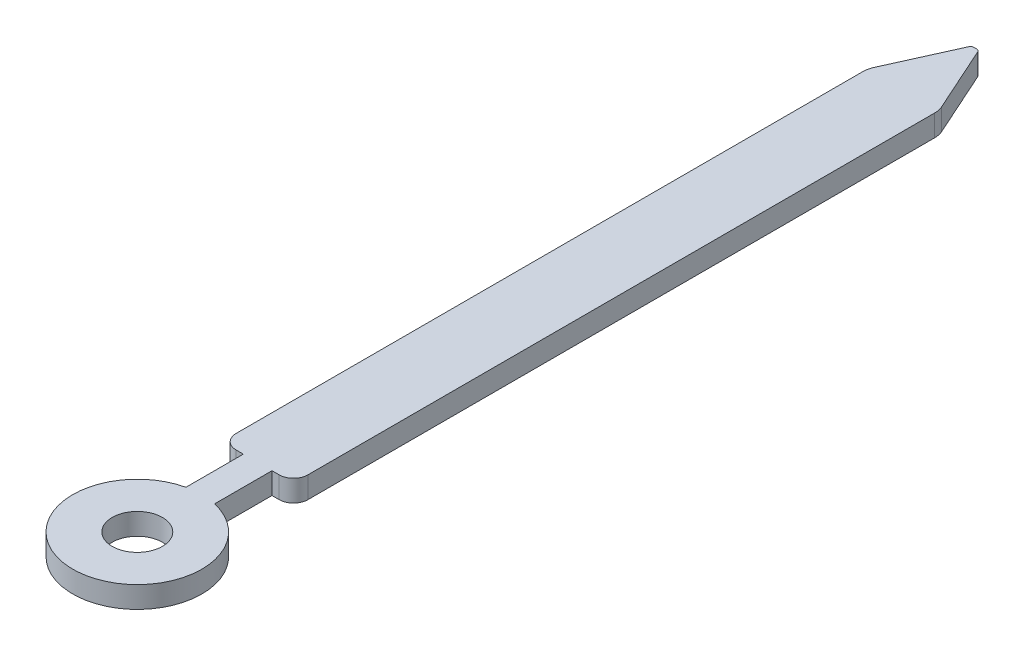
ISO-10303-21;
HEADER;
FILE_DESCRIPTION(('STEP AP214'),'2;1');
FILE_NAME('part.step','',(''),(''),'','','');
FILE_SCHEMA(('AUTOMOTIVE_DESIGN { 1 0 10303 214 1 1 1 1 }'));
ENDSEC;
DATA;
#1=APPLICATION_CONTEXT('core data for automotive mechanical design processes');
#2=APPLICATION_PROTOCOL_DEFINITION('international standard','automotive_design',2000,#1);
#3=PRODUCT_CONTEXT('',#1,'mechanical');
#4=PRODUCT('Part','Part','',(#3));
#5=PRODUCT_RELATED_PRODUCT_CATEGORY('part','',(#4));
#6=PRODUCT_DEFINITION_FORMATION('','',#4);
#7=PRODUCT_DEFINITION_CONTEXT('part definition',#1,'design');
#8=PRODUCT_DEFINITION('design','',#6,#7);
#9=PRODUCT_DEFINITION_SHAPE('','',#8);
#10=(LENGTH_UNIT() NAMED_UNIT(*) SI_UNIT(.MILLI.,.METRE.));
#11=(NAMED_UNIT(*) PLANE_ANGLE_UNIT() SI_UNIT($,.RADIAN.));
#12=(NAMED_UNIT(*) SI_UNIT($,.STERADIAN.) SOLID_ANGLE_UNIT());
#13=UNCERTAINTY_MEASURE_WITH_UNIT(LENGTH_MEASURE(1.E-05),#10,'distance_accuracy_value','');
#14=(GEOMETRIC_REPRESENTATION_CONTEXT(3) GLOBAL_UNCERTAINTY_ASSIGNED_CONTEXT((#13)) GLOBAL_UNIT_ASSIGNED_CONTEXT((#10,
#11,#12)) REPRESENTATION_CONTEXT('',''));
#15=CARTESIAN_POINT('',(0.,0.,0.));
#16=DIRECTION('',(0.,0.,1.));
#17=DIRECTION('',(1.,0.,0.));
#18=AXIS2_PLACEMENT_3D('',#15,#16,#17);
#19=CARTESIAN_POINT('',(-0.0183173051113198,0.3,-9.951));
#20=DIRECTION('',(0.,-1.,0.));
#21=DIRECTION('',(0.,0.,-1.));
#22=AXIS2_PLACEMENT_3D('',#19,#20,#21);
#23=PLANE('',#22);
#24=CARTESIAN_POINT('',(-0.0183173051113198,0.3,-9.951));
#25=DIRECTION('',(0.,1.,0.));
#26=DIRECTION('',(0.,0.,-1.));
#27=AXIS2_PLACEMENT_3D('',#24,#25,#26);
#28=CIRCLE('',#27,0.0490000000000003);
#29=CARTESIAN_POINT('',(-0.0183173051113196,0.3,-10.));
#30=VERTEX_POINT('',#29);
#31=CARTESIAN_POINT('',(-0.0630014588649001,0.3,-9.97110786918911));
#32=VERTEX_POINT('',#31);
#33=EDGE_CURVE('E207',#30,#32,#28,.T.);
#34=ORIENTED_EDGE('',*,*,#33,.T.);
#35=DIRECTION('',(-0.410364677328798,0.,0.911921505175106));
#36=VECTOR('',#35,1.);
#37=CARTESIAN_POINT('',(-0.0630014588649001,0.3,-9.97110786918911));
#38=LINE('',#37,#36);
#39=CARTESIAN_POINT('',(-0.473576451552531,0.3,-9.05871899654993));
#40=VERTEX_POINT('',#39);
#41=EDGE_CURVE('E115',#32,#40,#38,.T.);
#42=ORIENTED_EDGE('',*,*,#41,.T.);
#43=CARTESIAN_POINT('',(-0.2,0.3,-8.93560959335129));
#44=DIRECTION('',(0.,1.,0.));
#45=DIRECTION('',(0.,0.,1.));
#46=AXIS2_PLACEMENT_3D('',#43,#44,#45);
#47=CIRCLE('',#46,0.3);
#48=CARTESIAN_POINT('',(-0.5,0.3,-8.93560959335129));
#49=VERTEX_POINT('',#48);
#50=EDGE_CURVE('E246',#40,#49,#47,.T.);
#51=ORIENTED_EDGE('',*,*,#50,.T.);
#52=DIRECTION('',(0.,0.,1.));
#53=VECTOR('',#52,1.);
#54=CARTESIAN_POINT('',(-0.5,0.3,-0.200000000000001));
#55=LINE('',#54,#53);
#56=CARTESIAN_POINT('',(-0.5,0.3,-0.200000000000001));
#57=VERTEX_POINT('',#56);
#58=EDGE_CURVE('E265',#49,#57,#55,.T.);
#59=ORIENTED_EDGE('',*,*,#58,.T.);
#60=CARTESIAN_POINT('',(-0.3,0.3,-0.2));
#61=DIRECTION('',(0.,1.,0.));
#62=DIRECTION('',(0.,0.,-1.));
#63=AXIS2_PLACEMENT_3D('',#60,#61,#62);
#64=CIRCLE('',#63,0.2);
#65=CARTESIAN_POINT('',(-0.299999999999999,0.3,0.));
#66=VERTEX_POINT('',#65);
#67=EDGE_CURVE('E262',#57,#66,#64,.T.);
#68=ORIENTED_EDGE('',*,*,#67,.T.);
#69=DIRECTION('',(1.,0.,0.));
#70=VECTOR('',#69,1.);
#71=CARTESIAN_POINT('',(-0.299999999999999,0.3,0.));
#72=LINE('',#71,#70);
#73=CARTESIAN_POINT('',(-0.2,0.3,0.));
#74=VERTEX_POINT('',#73);
#75=EDGE_CURVE('E264',#66,#74,#72,.T.);
#76=ORIENTED_EDGE('',*,*,#75,.T.);
#77=DIRECTION('',(0.,0.,1.));
#78=VECTOR('',#77,1.);
#79=CARTESIAN_POINT('',(-0.2,0.3,0.));
#80=LINE('',#79,#78);
#81=CARTESIAN_POINT('',(-0.199999999999999,0.3,0.8));
#82=VERTEX_POINT('',#81);
#83=EDGE_CURVE('E267',#74,#82,#80,.T.);
#84=ORIENTED_EDGE('',*,*,#83,.T.);
#85=CARTESIAN_POINT('',(0.,0.3,1.67749643873921));
#86=DIRECTION('',(0.,1.,0.));
#87=DIRECTION('',(0.,0.,1.));
#88=AXIS2_PLACEMENT_3D('',#85,#86,#87);
#89=CIRCLE('',#88,0.9);
#90=CARTESIAN_POINT('',(0.200000000000001,0.3,0.8));
#91=VERTEX_POINT('',#90);
#92=EDGE_CURVE('E273',#82,#91,#89,.T.);
#93=ORIENTED_EDGE('',*,*,#92,.T.);
#94=DIRECTION('',(0.,0.,-1.));
#95=VECTOR('',#94,1.);
#96=CARTESIAN_POINT('',(0.2,0.3,0.));
#97=LINE('',#96,#95);
#98=CARTESIAN_POINT('',(0.2,0.3,0.));
#99=VERTEX_POINT('',#98);
#100=EDGE_CURVE('E275',#91,#99,#97,.T.);
#101=ORIENTED_EDGE('',*,*,#100,.T.);
#102=DIRECTION('',(1.,0.,0.));
#103=VECTOR('',#102,1.);
#104=CARTESIAN_POINT('',(0.2,0.3,0.));
#105=LINE('',#104,#103);
#106=CARTESIAN_POINT('',(0.299999999999999,0.3,0.));
#107=VERTEX_POINT('',#106);
#108=EDGE_CURVE('E277',#99,#107,#105,.T.);
#109=ORIENTED_EDGE('',*,*,#108,.T.);
#110=CARTESIAN_POINT('',(0.3,0.3,-0.2));
#111=DIRECTION('',(0.,1.,0.));
#112=DIRECTION('',(0.,0.,1.));
#113=AXIS2_PLACEMENT_3D('',#110,#111,#112);
#114=CIRCLE('',#113,0.2);
#115=CARTESIAN_POINT('',(0.5,0.3,-0.200000000000001));
#116=VERTEX_POINT('',#115);
#117=EDGE_CURVE('E279',#107,#116,#114,.T.);
#118=ORIENTED_EDGE('',*,*,#117,.T.);
#119=DIRECTION('',(0.,0.,-1.));
#120=VECTOR('',#119,1.);
#121=CARTESIAN_POINT('',(0.5,0.3,-0.200000000000001));
#122=LINE('',#121,#120);
#123=CARTESIAN_POINT('',(0.5,0.3,-8.93560959335129));
#124=VERTEX_POINT('',#123);
#125=EDGE_CURVE('E281',#116,#124,#122,.T.);
#126=ORIENTED_EDGE('',*,*,#125,.T.);
#127=CARTESIAN_POINT('',(0.2,0.3,-8.93560959335129));
#128=DIRECTION('',(0.,1.,0.));
#129=DIRECTION('',(0.,0.,-1.));
#130=AXIS2_PLACEMENT_3D('',#127,#128,#129);
#131=CIRCLE('',#130,0.3);
#132=CARTESIAN_POINT('',(0.473576451552531,0.3,-9.05871899654993));
#133=VERTEX_POINT('',#132);
#134=EDGE_CURVE('E158',#124,#133,#131,.T.);
#135=ORIENTED_EDGE('',*,*,#134,.T.);
#136=DIRECTION('',(-0.410364677328798,0.,-0.911921505175106));
#137=VECTOR('',#136,1.);
#138=CARTESIAN_POINT('',(0.0630014588649001,0.3,-9.97110786918911));
#139=LINE('',#138,#137);
#140=CARTESIAN_POINT('',(0.0630014588649001,0.3,-9.97110786918911));
#141=VERTEX_POINT('',#140);
#142=EDGE_CURVE('E152',#133,#141,#139,.T.);
#143=ORIENTED_EDGE('',*,*,#142,.T.);
#144=CARTESIAN_POINT('',(0.0183173051113198,0.3,-9.951));
#145=DIRECTION('',(0.,1.,0.));
#146=DIRECTION('',(0.,0.,1.));
#147=AXIS2_PLACEMENT_3D('',#144,#145,#146);
#148=CIRCLE('',#147,0.0490000000000003);
#149=CARTESIAN_POINT('',(0.0183173051113196,0.3,-10.));
#150=VERTEX_POINT('',#149);
#151=EDGE_CURVE('E156',#141,#150,#148,.T.);
#152=ORIENTED_EDGE('',*,*,#151,.T.);
#153=DIRECTION('',(-1.,0.,0.));
#154=VECTOR('',#153,1.);
#155=CARTESIAN_POINT('',(-0.0183173051113196,0.3,-10.));
#156=LINE('',#155,#154);
#157=EDGE_CURVE('E48',#150,#30,#156,.T.);
#158=ORIENTED_EDGE('',*,*,#157,.T.);
#159=EDGE_LOOP('',(#34,#42,#51,#59,#68,#76,#84,#93,#101,#109,#118,#126,#135,#143,#152,#158));
#160=FACE_BOUND('',#159,.T.);
#161=CARTESIAN_POINT('',(0.,0.3,1.67749643873921));
#162=DIRECTION('',(0.,1.,0.));
#163=DIRECTION('',(0.,0.,1.));
#164=AXIS2_PLACEMENT_3D('',#161,#162,#163);
#165=CIRCLE('',#164,0.35);
#166=CARTESIAN_POINT('',(0.,0.3,2.02749643873921));
#167=VERTEX_POINT('',#166);
#168=EDGE_CURVE('E180',#167,#167,#165,.T.);
#169=ORIENTED_EDGE('',*,*,#168,.F.);
#170=EDGE_LOOP('',(#169));
#171=FACE_BOUND('',#170,.T.);
#172=ADVANCED_FACE('F31',(#160,#171),#23,.F.);
#173=CARTESIAN_POINT('',(-0.0183173051113198,0.,-9.951));
#174=DIRECTION('',(0.,-1.,0.));
#175=DIRECTION('',(0.,0.,-1.));
#176=AXIS2_PLACEMENT_3D('',#173,#174,#175);
#177=PLANE('',#176);
#178=CARTESIAN_POINT('',(-0.0183173051113198,0.,-9.951));
#179=DIRECTION('',(0.,1.,0.));
#180=DIRECTION('',(0.,0.,-1.));
#181=AXIS2_PLACEMENT_3D('',#178,#179,#180);
#182=CIRCLE('',#181,0.0490000000000003);
#183=CARTESIAN_POINT('',(-0.0183173051113196,0.,-10.));
#184=VERTEX_POINT('',#183);
#185=CARTESIAN_POINT('',(-0.0630014588649001,0.,-9.97110786918911));
#186=VERTEX_POINT('',#185);
#187=EDGE_CURVE('E176',#184,#186,#182,.T.);
#188=ORIENTED_EDGE('',*,*,#187,.F.);
#189=DIRECTION('',(-1.,0.,0.));
#190=VECTOR('',#189,1.);
#191=CARTESIAN_POINT('',(-0.0183173051113196,0.,-10.));
#192=LINE('',#191,#190);
#193=CARTESIAN_POINT('',(0.0183173051113196,0.,-10.));
#194=VERTEX_POINT('',#193);
#195=EDGE_CURVE('E107',#194,#184,#192,.T.);
#196=ORIENTED_EDGE('',*,*,#195,.F.);
#197=CARTESIAN_POINT('',(0.0183173051113198,0.,-9.951));
#198=DIRECTION('',(0.,1.,0.));
#199=DIRECTION('',(0.,0.,1.));
#200=AXIS2_PLACEMENT_3D('',#197,#198,#199);
#201=CIRCLE('',#200,0.0490000000000003);
#202=CARTESIAN_POINT('',(0.0630014588649001,0.,-9.97110786918911));
#203=VERTEX_POINT('',#202);
#204=EDGE_CURVE('E101',#203,#194,#201,.T.);
#205=ORIENTED_EDGE('',*,*,#204,.F.);
#206=DIRECTION('',(-0.410364677328798,0.,-0.911921505175106));
#207=VECTOR('',#206,1.);
#208=CARTESIAN_POINT('',(0.0630014588649001,0.,-9.97110786918911));
#209=LINE('',#208,#207);
#210=CARTESIAN_POINT('',(0.473576451552531,0.,-9.05871899654993));
#211=VERTEX_POINT('',#210);
#212=EDGE_CURVE('E166',#211,#203,#209,.T.);
#213=ORIENTED_EDGE('',*,*,#212,.F.);
#214=CARTESIAN_POINT('',(0.2,0.,-8.93560959335129));
#215=DIRECTION('',(0.,1.,0.));
#216=DIRECTION('',(0.,0.,-1.));
#217=AXIS2_PLACEMENT_3D('',#214,#215,#216);
#218=CIRCLE('',#217,0.3);
#219=CARTESIAN_POINT('',(0.5,0.,-8.93560959335129));
#220=VERTEX_POINT('',#219);
#221=EDGE_CURVE('E202',#220,#211,#218,.T.);
#222=ORIENTED_EDGE('',*,*,#221,.F.);
#223=DIRECTION('',(0.,0.,-1.));
#224=VECTOR('',#223,1.);
#225=CARTESIAN_POINT('',(0.5,0.,-0.200000000000001));
#226=LINE('',#225,#224);
#227=CARTESIAN_POINT('',(0.5,0.,-0.200000000000001));
#228=VERTEX_POINT('',#227);
#229=EDGE_CURVE('E200',#228,#220,#226,.T.);
#230=ORIENTED_EDGE('',*,*,#229,.F.);
#231=CARTESIAN_POINT('',(0.3,0.,-0.2));
#232=DIRECTION('',(0.,1.,0.));
#233=DIRECTION('',(0.,0.,1.));
#234=AXIS2_PLACEMENT_3D('',#231,#232,#233);
#235=CIRCLE('',#234,0.2);
#236=CARTESIAN_POINT('',(0.299999999999999,0.,0.));
#237=VERTEX_POINT('',#236);
#238=EDGE_CURVE('E198',#237,#228,#235,.T.);
#239=ORIENTED_EDGE('',*,*,#238,.F.);
#240=DIRECTION('',(1.,0.,0.));
#241=VECTOR('',#240,1.);
#242=CARTESIAN_POINT('',(0.2,0.,0.));
#243=LINE('',#242,#241);
#244=CARTESIAN_POINT('',(0.2,0.,0.));
#245=VERTEX_POINT('',#244);
#246=EDGE_CURVE('E196',#245,#237,#243,.T.);
#247=ORIENTED_EDGE('',*,*,#246,.F.);
#248=DIRECTION('',(0.,0.,-1.));
#249=VECTOR('',#248,1.);
#250=CARTESIAN_POINT('',(0.2,0.,0.));
#251=LINE('',#250,#249);
#252=CARTESIAN_POINT('',(0.200000000000001,0.,0.8));
#253=VERTEX_POINT('',#252);
#254=EDGE_CURVE('E194',#253,#245,#251,.T.);
#255=ORIENTED_EDGE('',*,*,#254,.F.);
#256=CARTESIAN_POINT('',(0.,0.,1.67749643873921));
#257=DIRECTION('',(0.,1.,0.));
#258=DIRECTION('',(0.,0.,1.));
#259=AXIS2_PLACEMENT_3D('',#256,#257,#258);
#260=CIRCLE('',#259,0.9);
#261=CARTESIAN_POINT('',(-0.199999999999999,0.,0.8));
#262=VERTEX_POINT('',#261);
#263=EDGE_CURVE('E192',#262,#253,#260,.T.);
#264=ORIENTED_EDGE('',*,*,#263,.F.);
#265=DIRECTION('',(0.,0.,1.));
#266=VECTOR('',#265,1.);
#267=CARTESIAN_POINT('',(-0.2,0.,0.));
#268=LINE('',#267,#266);
#269=CARTESIAN_POINT('',(-0.2,0.,0.));
#270=VERTEX_POINT('',#269);
#271=EDGE_CURVE('E190',#270,#262,#268,.T.);
#272=ORIENTED_EDGE('',*,*,#271,.F.);
#273=DIRECTION('',(1.,0.,0.));
#274=VECTOR('',#273,1.);
#275=CARTESIAN_POINT('',(-0.299999999999999,0.,0.));
#276=LINE('',#275,#274);
#277=CARTESIAN_POINT('',(-0.299999999999999,0.,0.));
#278=VERTEX_POINT('',#277);
#279=EDGE_CURVE('E188',#278,#270,#276,.T.);
#280=ORIENTED_EDGE('',*,*,#279,.F.);
#281=CARTESIAN_POINT('',(-0.3,0.,-0.2));
#282=DIRECTION('',(0.,1.,0.));
#283=DIRECTION('',(0.,0.,-1.));
#284=AXIS2_PLACEMENT_3D('',#281,#282,#283);
#285=CIRCLE('',#284,0.2);
#286=CARTESIAN_POINT('',(-0.5,0.,-0.200000000000001));
#287=VERTEX_POINT('',#286);
#288=EDGE_CURVE('E186',#287,#278,#285,.T.);
#289=ORIENTED_EDGE('',*,*,#288,.F.);
#290=DIRECTION('',(0.,0.,1.));
#291=VECTOR('',#290,1.);
#292=CARTESIAN_POINT('',(-0.5,0.,-0.200000000000001));
#293=LINE('',#292,#291);
#294=CARTESIAN_POINT('',(-0.5,0.,-8.93560959335129));
#295=VERTEX_POINT('',#294);
#296=EDGE_CURVE('E184',#295,#287,#293,.T.);
#297=ORIENTED_EDGE('',*,*,#296,.F.);
#298=CARTESIAN_POINT('',(-0.2,0.,-8.93560959335129));
#299=DIRECTION('',(0.,1.,0.));
#300=DIRECTION('',(0.,0.,1.));
#301=AXIS2_PLACEMENT_3D('',#298,#299,#300);
#302=CIRCLE('',#301,0.3);
#303=CARTESIAN_POINT('',(-0.473576451552531,0.,-9.05871899654993));
#304=VERTEX_POINT('',#303);
#305=EDGE_CURVE('E182',#304,#295,#302,.T.);
#306=ORIENTED_EDGE('',*,*,#305,.F.);
#307=DIRECTION('',(-0.410364677328798,0.,0.911921505175106));
#308=VECTOR('',#307,1.);
#309=CARTESIAN_POINT('',(-0.0630014588649001,0.,-9.97110786918911));
#310=LINE('',#309,#308);
#311=EDGE_CURVE('E179',#186,#304,#310,.T.);
#312=ORIENTED_EDGE('',*,*,#311,.F.);
#313=EDGE_LOOP('',(#188,#196,#205,#213,#222,#230,#239,#247,#255,#264,#272,#280,#289,#297,#306,#312));
#314=FACE_BOUND('',#313,.T.);
#315=CARTESIAN_POINT('',(0.,0.,1.67749643873921));
#316=DIRECTION('',(0.,1.,0.));
#317=DIRECTION('',(0.,0.,1.));
#318=AXIS2_PLACEMENT_3D('',#315,#316,#317);
#319=CIRCLE('',#318,0.35);
#320=CARTESIAN_POINT('',(0.,0.,2.02749643873921));
#321=VERTEX_POINT('',#320);
#322=EDGE_CURVE('E480',#321,#321,#319,.T.);
#323=ORIENTED_EDGE('',*,*,#322,.T.);
#324=EDGE_LOOP('',(#323));
#325=FACE_BOUND('',#324,.T.);
#326=ADVANCED_FACE('F250',(#314,#325),#177,.T.);
#327=CARTESIAN_POINT('',(-0.0183173051113198,0.3,-9.951));
#328=DIRECTION('',(0.,-1.,0.));
#329=DIRECTION('',(0.,0.,-1.));
#330=AXIS2_PLACEMENT_3D('',#327,#328,#329);
#331=CYLINDRICAL_SURFACE('',#330,0.0490000000000003);
#332=ORIENTED_EDGE('',*,*,#187,.T.);
#333=DIRECTION('',(0.,-1.,0.));
#334=VECTOR('',#333,1.);
#335=CARTESIAN_POINT('',(-0.0630014588649001,0.3,-9.97110786918911));
#336=LINE('',#335,#334);
#337=EDGE_CURVE('E11',#32,#186,#336,.T.);
#338=ORIENTED_EDGE('',*,*,#337,.F.);
#339=ORIENTED_EDGE('',*,*,#33,.F.);
#340=DIRECTION('',(0.,-1.,0.));
#341=VECTOR('',#340,1.);
#342=CARTESIAN_POINT('',(-0.0183173051113196,0.3,-10.));
#343=LINE('',#342,#341);
#344=EDGE_CURVE('E172',#30,#184,#343,.T.);
#345=ORIENTED_EDGE('',*,*,#344,.T.);
#346=EDGE_LOOP('',(#332,#338,#339,#345));
#347=FACE_BOUND('',#346,.T.);
#348=ADVANCED_FACE('F33',(#347),#331,.T.);
#349=CARTESIAN_POINT('',(-0.0630014588649001,0.3,-9.97110786918911));
#350=DIRECTION('',(0.911921505175106,0.,0.410364677328798));
#351=DIRECTION('',(0.410364677328798,0.,-0.911921505175106));
#352=AXIS2_PLACEMENT_3D('',#349,#350,#351);
#353=PLANE('',#352);
#354=ORIENTED_EDGE('',*,*,#311,.T.);
#355=DIRECTION('',(0.,-1.,0.));
#356=VECTOR('',#355,1.);
#357=CARTESIAN_POINT('',(-0.473576451552531,0.3,-9.05871899654993));
#358=LINE('',#357,#356);
#359=EDGE_CURVE('E40',#40,#304,#358,.T.);
#360=ORIENTED_EDGE('',*,*,#359,.F.);
#361=ORIENTED_EDGE('',*,*,#41,.F.);
#362=ORIENTED_EDGE('',*,*,#337,.T.);
#363=EDGE_LOOP('',(#354,#360,#361,#362));
#364=FACE_BOUND('',#363,.T.);
#365=ADVANCED_FACE('F315',(#364),#353,.F.);
#366=CARTESIAN_POINT('',(-0.2,0.3,-8.93560959335129));
#367=DIRECTION('',(0.,-1.,0.));
#368=DIRECTION('',(0.,0.,-1.));
#369=AXIS2_PLACEMENT_3D('',#366,#367,#368);
#370=CYLINDRICAL_SURFACE('',#369,0.3);
#371=ORIENTED_EDGE('',*,*,#305,.T.);
#372=DIRECTION('',(0.,-1.,0.));
#373=VECTOR('',#372,1.);
#374=CARTESIAN_POINT('',(-0.5,0.3,-8.93560959335129));
#375=LINE('',#374,#373);
#376=EDGE_CURVE('E238',#49,#295,#375,.T.);
#377=ORIENTED_EDGE('',*,*,#376,.F.);
#378=ORIENTED_EDGE('',*,*,#50,.F.);
#379=ORIENTED_EDGE('',*,*,#359,.T.);
#380=EDGE_LOOP('',(#371,#377,#378,#379));
#381=FACE_BOUND('',#380,.T.);
#382=ADVANCED_FACE('F244',(#381),#370,.T.);
#383=CARTESIAN_POINT('',(-0.5,0.3,-0.200000000000001));
#384=DIRECTION('',(1.,0.,0.));
#385=DIRECTION('',(0.,0.,-1.));
#386=AXIS2_PLACEMENT_3D('',#383,#384,#385);
#387=PLANE('',#386);
#388=ORIENTED_EDGE('',*,*,#296,.T.);
#389=DIRECTION('',(0.,-1.,0.));
#390=VECTOR('',#389,1.);
#391=CARTESIAN_POINT('',(-0.5,0.3,-0.200000000000001));
#392=LINE('',#391,#390);
#393=EDGE_CURVE('E235',#57,#287,#392,.T.);
#394=ORIENTED_EDGE('',*,*,#393,.F.);
#395=ORIENTED_EDGE('',*,*,#58,.F.);
#396=ORIENTED_EDGE('',*,*,#376,.T.);
#397=EDGE_LOOP('',(#388,#394,#395,#396));
#398=FACE_BOUND('',#397,.T.);
#399=ADVANCED_FACE('F256',(#398),#387,.F.);
#400=CARTESIAN_POINT('',(-0.3,0.3,-0.2));
#401=DIRECTION('',(0.,-1.,0.));
#402=DIRECTION('',(0.,0.,-1.));
#403=AXIS2_PLACEMENT_3D('',#400,#401,#402);
#404=CYLINDRICAL_SURFACE('',#403,0.2);
#405=ORIENTED_EDGE('',*,*,#288,.T.);
#406=DIRECTION('',(0.,-1.,0.));
#407=VECTOR('',#406,1.);
#408=CARTESIAN_POINT('',(-0.299999999999999,0.3,0.));
#409=LINE('',#408,#407);
#410=EDGE_CURVE('E232',#66,#278,#409,.T.);
#411=ORIENTED_EDGE('',*,*,#410,.F.);
#412=ORIENTED_EDGE('',*,*,#67,.F.);
#413=ORIENTED_EDGE('',*,*,#393,.T.);
#414=EDGE_LOOP('',(#405,#411,#412,#413));
#415=FACE_BOUND('',#414,.T.);
#416=ADVANCED_FACE('F260',(#415),#404,.T.);
#417=CARTESIAN_POINT('',(-0.299999999999999,0.3,0.));
#418=DIRECTION('',(0.,0.,-1.));
#419=DIRECTION('',(-1.,0.,0.));
#420=AXIS2_PLACEMENT_3D('',#417,#418,#419);
#421=PLANE('',#420);
#422=ORIENTED_EDGE('',*,*,#279,.T.);
#423=DIRECTION('',(0.,-1.,0.));
#424=VECTOR('',#423,1.);
#425=CARTESIAN_POINT('',(-0.2,0.3,0.));
#426=LINE('',#425,#424);
#427=EDGE_CURVE('E229',#74,#270,#426,.T.);
#428=ORIENTED_EDGE('',*,*,#427,.F.);
#429=ORIENTED_EDGE('',*,*,#75,.F.);
#430=ORIENTED_EDGE('',*,*,#410,.T.);
#431=EDGE_LOOP('',(#422,#428,#429,#430));
#432=FACE_BOUND('',#431,.T.);
#433=ADVANCED_FACE('F328',(#432),#421,.F.);
#434=CARTESIAN_POINT('',(-0.2,0.3,0.));
#435=DIRECTION('',(1.,0.,0.));
#436=DIRECTION('',(0.,0.,-1.));
#437=AXIS2_PLACEMENT_3D('',#434,#435,#436);
#438=PLANE('',#437);
#439=ORIENTED_EDGE('',*,*,#271,.T.);
#440=DIRECTION('',(0.,-1.,0.));
#441=VECTOR('',#440,1.);
#442=CARTESIAN_POINT('',(-0.199999999999999,0.3,0.8));
#443=LINE('',#442,#441);
#444=EDGE_CURVE('E226',#82,#262,#443,.T.);
#445=ORIENTED_EDGE('',*,*,#444,.F.);
#446=ORIENTED_EDGE('',*,*,#83,.F.);
#447=ORIENTED_EDGE('',*,*,#427,.T.);
#448=EDGE_LOOP('',(#439,#445,#446,#447));
#449=FACE_BOUND('',#448,.T.);
#450=ADVANCED_FACE('F331',(#449),#438,.F.);
#451=CARTESIAN_POINT('',(0.,0.3,1.67749643873921));
#452=DIRECTION('',(0.,-1.,0.));
#453=DIRECTION('',(0.,0.,-1.));
#454=AXIS2_PLACEMENT_3D('',#451,#452,#453);
#455=CYLINDRICAL_SURFACE('',#454,0.9);
#456=ORIENTED_EDGE('',*,*,#263,.T.);
#457=DIRECTION('',(0.,-1.,0.));
#458=VECTOR('',#457,1.);
#459=CARTESIAN_POINT('',(0.200000000000001,0.3,0.8));
#460=LINE('',#459,#458);
#461=EDGE_CURVE('E223',#91,#253,#460,.T.);
#462=ORIENTED_EDGE('',*,*,#461,.F.);
#463=ORIENTED_EDGE('',*,*,#92,.F.);
#464=ORIENTED_EDGE('',*,*,#444,.T.);
#465=EDGE_LOOP('',(#456,#462,#463,#464));
#466=FACE_BOUND('',#465,.T.);
#467=ADVANCED_FACE('F335',(#466),#455,.T.);
#468=CARTESIAN_POINT('',(0.2,0.3,0.));
#469=DIRECTION('',(-1.,0.,0.));
#470=DIRECTION('',(0.,0.,1.));
#471=AXIS2_PLACEMENT_3D('',#468,#469,#470);
#472=PLANE('',#471);
#473=ORIENTED_EDGE('',*,*,#254,.T.);
#474=DIRECTION('',(0.,-1.,0.));
#475=VECTOR('',#474,1.);
#476=CARTESIAN_POINT('',(0.2,0.3,0.));
#477=LINE('',#476,#475);
#478=EDGE_CURVE('E220',#99,#245,#477,.T.);
#479=ORIENTED_EDGE('',*,*,#478,.F.);
#480=ORIENTED_EDGE('',*,*,#100,.F.);
#481=ORIENTED_EDGE('',*,*,#461,.T.);
#482=EDGE_LOOP('',(#473,#479,#480,#481));
#483=FACE_BOUND('',#482,.T.);
#484=ADVANCED_FACE('F339',(#483),#472,.F.);
#485=CARTESIAN_POINT('',(0.2,0.3,0.));
#486=DIRECTION('',(0.,0.,-1.));
#487=DIRECTION('',(-1.,0.,0.));
#488=AXIS2_PLACEMENT_3D('',#485,#486,#487);
#489=PLANE('',#488);
#490=ORIENTED_EDGE('',*,*,#246,.T.);
#491=DIRECTION('',(0.,-1.,0.));
#492=VECTOR('',#491,1.);
#493=CARTESIAN_POINT('',(0.299999999999999,0.3,0.));
#494=LINE('',#493,#492);
#495=EDGE_CURVE('E217',#107,#237,#494,.T.);
#496=ORIENTED_EDGE('',*,*,#495,.F.);
#497=ORIENTED_EDGE('',*,*,#108,.F.);
#498=ORIENTED_EDGE('',*,*,#478,.T.);
#499=EDGE_LOOP('',(#490,#496,#497,#498));
#500=FACE_BOUND('',#499,.T.);
#501=ADVANCED_FACE('F343',(#500),#489,.F.);
#502=CARTESIAN_POINT('',(0.3,0.3,-0.2));
#503=DIRECTION('',(0.,-1.,0.));
#504=DIRECTION('',(0.,0.,-1.));
#505=AXIS2_PLACEMENT_3D('',#502,#503,#504);
#506=CYLINDRICAL_SURFACE('',#505,0.2);
#507=ORIENTED_EDGE('',*,*,#238,.T.);
#508=DIRECTION('',(0.,-1.,0.));
#509=VECTOR('',#508,1.);
#510=CARTESIAN_POINT('',(0.5,0.3,-0.200000000000001));
#511=LINE('',#510,#509);
#512=EDGE_CURVE('E214',#116,#228,#511,.T.);
#513=ORIENTED_EDGE('',*,*,#512,.F.);
#514=ORIENTED_EDGE('',*,*,#117,.F.);
#515=ORIENTED_EDGE('',*,*,#495,.T.);
#516=EDGE_LOOP('',(#507,#513,#514,#515));
#517=FACE_BOUND('',#516,.T.);
#518=ADVANCED_FACE('F347',(#517),#506,.T.);
#519=CARTESIAN_POINT('',(0.5,0.3,-0.200000000000001));
#520=DIRECTION('',(-1.,0.,0.));
#521=DIRECTION('',(0.,0.,1.));
#522=AXIS2_PLACEMENT_3D('',#519,#520,#521);
#523=PLANE('',#522);
#524=ORIENTED_EDGE('',*,*,#229,.T.);
#525=DIRECTION('',(0.,-1.,0.));
#526=VECTOR('',#525,1.);
#527=CARTESIAN_POINT('',(0.5,0.3,-8.93560959335129));
#528=LINE('',#527,#526);
#529=EDGE_CURVE('E211',#124,#220,#528,.T.);
#530=ORIENTED_EDGE('',*,*,#529,.F.);
#531=ORIENTED_EDGE('',*,*,#125,.F.);
#532=ORIENTED_EDGE('',*,*,#512,.T.);
#533=EDGE_LOOP('',(#524,#530,#531,#532));
#534=FACE_BOUND('',#533,.T.);
#535=ADVANCED_FACE('F287',(#534),#523,.F.);
#536=CARTESIAN_POINT('',(0.2,0.3,-8.93560959335129));
#537=DIRECTION('',(0.,-1.,0.));
#538=DIRECTION('',(0.,0.,-1.));
#539=AXIS2_PLACEMENT_3D('',#536,#537,#538);
#540=CYLINDRICAL_SURFACE('',#539,0.3);
#541=ORIENTED_EDGE('',*,*,#221,.T.);
#542=DIRECTION('',(0.,-1.,0.));
#543=VECTOR('',#542,1.);
#544=CARTESIAN_POINT('',(0.473576451552531,0.3,-9.05871899654993));
#545=LINE('',#544,#543);
#546=EDGE_CURVE('E167',#133,#211,#545,.T.);
#547=ORIENTED_EDGE('',*,*,#546,.F.);
#548=ORIENTED_EDGE('',*,*,#134,.F.);
#549=ORIENTED_EDGE('',*,*,#529,.T.);
#550=EDGE_LOOP('',(#541,#547,#548,#549));
#551=FACE_BOUND('',#550,.T.);
#552=ADVANCED_FACE('F291',(#551),#540,.T.);
#553=CARTESIAN_POINT('',(0.0630014588649001,0.3,-9.97110786918911));
#554=DIRECTION('',(-0.911921505175106,0.,0.410364677328798));
#555=DIRECTION('',(0.410364677328798,0.,0.911921505175106));
#556=AXIS2_PLACEMENT_3D('',#553,#554,#555);
#557=PLANE('',#556);
#558=ORIENTED_EDGE('',*,*,#212,.T.);
#559=DIRECTION('',(0.,-1.,0.));
#560=VECTOR('',#559,1.);
#561=CARTESIAN_POINT('',(0.0630014588649001,0.3,-9.97110786918911));
#562=LINE('',#561,#560);
#563=EDGE_CURVE('E163',#141,#203,#562,.T.);
#564=ORIENTED_EDGE('',*,*,#563,.F.);
#565=ORIENTED_EDGE('',*,*,#142,.F.);
#566=ORIENTED_EDGE('',*,*,#546,.T.);
#567=EDGE_LOOP('',(#558,#564,#565,#566));
#568=FACE_BOUND('',#567,.T.);
#569=ADVANCED_FACE('F164',(#568),#557,.F.);
#570=CARTESIAN_POINT('',(0.0183173051113198,0.3,-9.951));
#571=DIRECTION('',(0.,-1.,0.));
#572=DIRECTION('',(0.,0.,-1.));
#573=AXIS2_PLACEMENT_3D('',#570,#571,#572);
#574=CYLINDRICAL_SURFACE('',#573,0.0490000000000003);
#575=ORIENTED_EDGE('',*,*,#204,.T.);
#576=DIRECTION('',(0.,-1.,0.));
#577=VECTOR('',#576,1.);
#578=CARTESIAN_POINT('',(0.0183173051113196,0.3,-10.));
#579=LINE('',#578,#577);
#580=EDGE_CURVE('E168',#150,#194,#579,.T.);
#581=ORIENTED_EDGE('',*,*,#580,.F.);
#582=ORIENTED_EDGE('',*,*,#151,.F.);
#583=ORIENTED_EDGE('',*,*,#563,.T.);
#584=EDGE_LOOP('',(#575,#581,#582,#583));
#585=FACE_BOUND('',#584,.T.);
#586=ADVANCED_FACE('F170',(#585),#574,.T.);
#587=CARTESIAN_POINT('',(-0.0183173051113196,0.3,-10.));
#588=DIRECTION('',(0.,0.,1.));
#589=DIRECTION('',(1.,0.,0.));
#590=AXIS2_PLACEMENT_3D('',#587,#588,#589);
#591=PLANE('',#590);
#592=ORIENTED_EDGE('',*,*,#195,.T.);
#593=ORIENTED_EDGE('',*,*,#344,.F.);
#594=ORIENTED_EDGE('',*,*,#157,.F.);
#595=ORIENTED_EDGE('',*,*,#580,.T.);
#596=EDGE_LOOP('',(#592,#593,#594,#595));
#597=FACE_BOUND('',#596,.T.);
#598=ADVANCED_FACE('F295',(#597),#591,.F.);
#599=CARTESIAN_POINT('',(0.,0.3,1.67749643873921));
#600=DIRECTION('',(0.,-1.,0.));
#601=DIRECTION('',(0.,0.,-1.));
#602=AXIS2_PLACEMENT_3D('',#599,#600,#601);
#603=CYLINDRICAL_SURFACE('',#602,0.35);
#604=ORIENTED_EDGE('',*,*,#168,.T.);
#605=EDGE_LOOP('',(#604));
#606=FACE_BOUND('',#605,.T.);
#607=ORIENTED_EDGE('',*,*,#322,.F.);
#608=EDGE_LOOP('',(#607));
#609=FACE_BOUND('',#608,.T.);
#610=ADVANCED_FACE('F297',(#606,#609),#603,.F.);
#611=CLOSED_SHELL('',(#172,#326,#348,#365,#382,#399,#416,#433,#450,#467,#484,#501,#518,#535,
#552,#569,#586,#598,#610));
#612=MANIFOLD_SOLID_BREP('B2',#611);
#613=ADVANCED_BREP_SHAPE_REPRESENTATION('',(#18,#612),#14);
#614=SHAPE_DEFINITION_REPRESENTATION(#9,#613);
ENDSEC;
END-ISO-10303-21;
